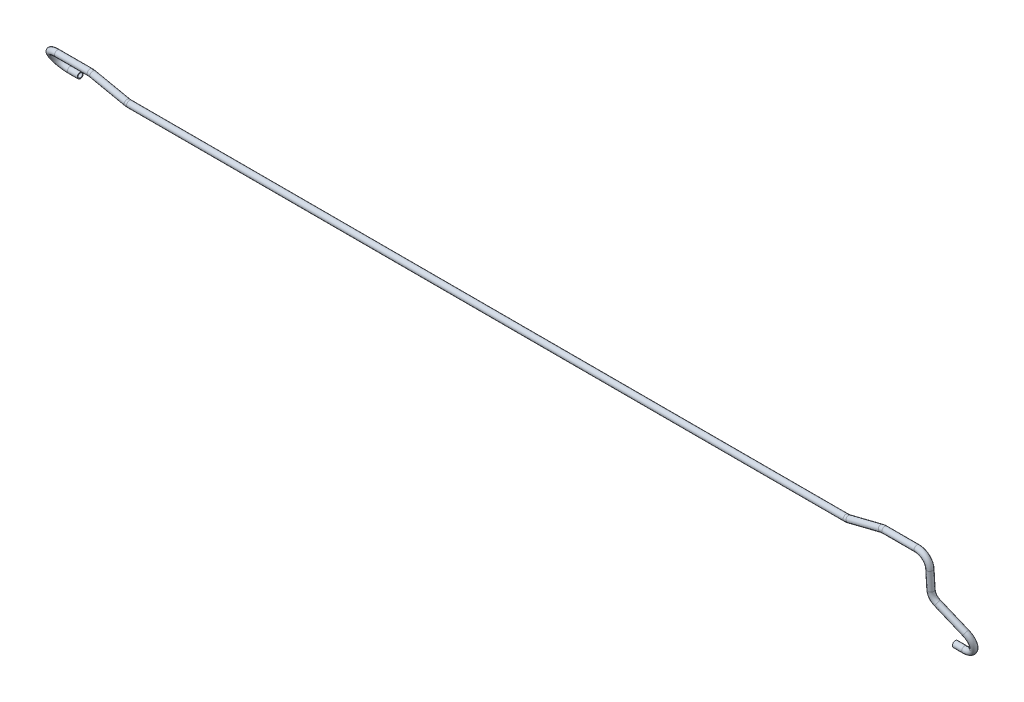
ISO-10303-21;
HEADER;
FILE_DESCRIPTION(('STEP AP214'),'2;1');
FILE_NAME('part.step','',(''),(''),'','','');
FILE_SCHEMA(('AUTOMOTIVE_DESIGN { 1 0 10303 214 1 1 1 1 }'));
ENDSEC;
DATA;
#1=APPLICATION_CONTEXT('core data for automotive mechanical design processes');
#2=APPLICATION_PROTOCOL_DEFINITION('international standard','automotive_design',2000,#1);
#3=PRODUCT_CONTEXT('',#1,'mechanical');
#4=PRODUCT('Part','Part','',(#3));
#5=PRODUCT_RELATED_PRODUCT_CATEGORY('part','',(#4));
#6=PRODUCT_DEFINITION_FORMATION('','',#4);
#7=PRODUCT_DEFINITION_CONTEXT('part definition',#1,'design');
#8=PRODUCT_DEFINITION('design','',#6,#7);
#9=PRODUCT_DEFINITION_SHAPE('','',#8);
#10=(LENGTH_UNIT() NAMED_UNIT(*) SI_UNIT(.MILLI.,.METRE.));
#11=(NAMED_UNIT(*) PLANE_ANGLE_UNIT() SI_UNIT($,.RADIAN.));
#12=(NAMED_UNIT(*) SI_UNIT($,.STERADIAN.) SOLID_ANGLE_UNIT());
#13=UNCERTAINTY_MEASURE_WITH_UNIT(LENGTH_MEASURE(1.E-05),#10,'distance_accuracy_value','');
#14=(GEOMETRIC_REPRESENTATION_CONTEXT(3) GLOBAL_UNCERTAINTY_ASSIGNED_CONTEXT((#13)) GLOBAL_UNIT_ASSIGNED_CONTEXT((#10,
#11,#12)) REPRESENTATION_CONTEXT('',''));
#15=CARTESIAN_POINT('',(0.,0.,0.));
#16=DIRECTION('',(0.,0.,1.));
#17=DIRECTION('',(1.,0.,0.));
#18=AXIS2_PLACEMENT_3D('',#15,#16,#17);
#19=CARTESIAN_POINT('',(-2402.5,149.044660665849,-2.77555756156289E-13));
#20=DIRECTION('',(1.,0.,0.));
#21=DIRECTION('',(0.,1.,0.));
#22=AXIS2_PLACEMENT_3D('',#19,#20,#21);
#23=CYLINDRICAL_SURFACE('',#22,8.);
#24=CARTESIAN_POINT('',(-2402.5,149.044660665849,-2.77555756156289E-13));
#25=DIRECTION('',(1.,0.,0.));
#26=DIRECTION('',(0.,0.610910901887657,-0.791699355787796));
#27=AXIS2_PLACEMENT_3D('',#24,#25,#26);
#28=CIRCLE('',#27,8.);
#29=CARTESIAN_POINT('',(-2402.5,142.262195292013,-4.24242424242452));
#30=VERTEX_POINT('',#29);
#31=EDGE_CURVE('E47',#30,#30,#28,.T.);
#32=ORIENTED_EDGE('',*,*,#31,.T.);
#33=EDGE_LOOP('',(#32));
#34=FACE_BOUND('',#33,.T.);
#35=CARTESIAN_POINT('',(-2375.5,149.044660665849,-2.22044604925031E-13));
#36=DIRECTION('',(1.,0.,0.));
#37=DIRECTION('',(0.,0.610910901887657,-0.791699355787796));
#38=AXIS2_PLACEMENT_3D('',#35,#36,#37);
#39=CIRCLE('',#38,8.);
#40=CARTESIAN_POINT('',(-2375.5,153.93194788095,-6.33359484630259));
#41=VERTEX_POINT('',#40);
#42=EDGE_CURVE('E10',#41,#41,#39,.T.);
#43=ORIENTED_EDGE('',*,*,#42,.F.);
#44=EDGE_LOOP('',(#43));
#45=FACE_BOUND('',#44,.T.);
#46=ADVANCED_FACE('F37',(#34,#45),#23,.T.);
#47=CARTESIAN_POINT('',(-2402.5,149.044660665849,-2.77555756156289E-13));
#48=DIRECTION('',(1.,0.,0.));
#49=DIRECTION('',(0.,1.,0.));
#50=AXIS2_PLACEMENT_3D('',#47,#48,#49);
#51=CYLINDRICAL_SURFACE('',#50,6.);
#52=CARTESIAN_POINT('',(-2402.5,149.044660665849,-2.77555756156289E-13));
#53=DIRECTION('',(1.,0.,0.));
#54=DIRECTION('',(0.,0.610910901887657,-0.791699355787796));
#55=AXIS2_PLACEMENT_3D('',#52,#53,#54);
#56=CIRCLE('',#55,6.);
#57=CARTESIAN_POINT('',(-2402.5,143.957811635472,-3.18181818181845));
#58=VERTEX_POINT('',#57);
#59=EDGE_CURVE('E51',#58,#58,#56,.T.);
#60=ORIENTED_EDGE('',*,*,#59,.F.);
#61=EDGE_LOOP('',(#60));
#62=FACE_BOUND('',#61,.T.);
#63=CARTESIAN_POINT('',(-2375.5,149.044660665849,-2.22044604925031E-13));
#64=DIRECTION('',(1.,0.,0.));
#65=DIRECTION('',(0.,0.610910901887657,-0.791699355787796));
#66=AXIS2_PLACEMENT_3D('',#63,#64,#65);
#67=CIRCLE('',#66,6.);
#68=CARTESIAN_POINT('',(-2375.5,152.710126077175,-4.750196134727));
#69=VERTEX_POINT('',#68);
#70=EDGE_CURVE('E43',#69,#69,#67,.T.);
#71=ORIENTED_EDGE('',*,*,#70,.T.);
#72=EDGE_LOOP('',(#71));
#73=FACE_BOUND('',#72,.T.);
#74=ADVANCED_FACE('F261',(#62,#73),#51,.F.);
#75=CARTESIAN_POINT('',(-2402.5,177.022330332924,17.4999999999997));
#76=DIRECTION('',(0.,-0.530303030303033,0.847808171729561));
#77=DIRECTION('',(0.,-0.847808171729561,-0.530303030303033));
#78=AXIS2_PLACEMENT_3D('',#75,#76,#77);
#79=TOROIDAL_SURFACE('',#78,32.9999999999998,8.);
#80=CARTESIAN_POINT('',(-2402.5,205.,34.9999999999997));
#81=DIRECTION('',(-1.,0.,0.));
#82=DIRECTION('',(0.,0.444579946800643,-0.895739175710619));
#83=AXIS2_PLACEMENT_3D('',#80,#81,#82);
#84=CIRCLE('',#83,8.);
#85=CARTESIAN_POINT('',(-2402.5,211.782465373836,39.242424242424));
#86=VERTEX_POINT('',#85);
#87=EDGE_CURVE('E56',#86,#86,#84,.T.);
#88=CARTESIAN_POINT('',(-2402.5,177.022330332924,17.4999999999997));
#89=DIRECTION('',(0.,-0.530303030303033,0.847808171729561));
#90=DIRECTION('',(0.,-0.847808171729561,-0.530303030303033));
#91=AXIS2_PLACEMENT_3D('',#88,#89,#90);
#92=CIRCLE('',#91,40.9999999999998);
#93=EDGE_CURVE('',#86,#30,#92,.T.);
#94=ORIENTED_EDGE('',*,*,#87,.T.);
#95=ORIENTED_EDGE('',*,*,#31,.F.);
#96=ORIENTED_EDGE('',*,*,#93,.T.);
#97=ORIENTED_EDGE('',*,*,#93,.F.);
#98=EDGE_LOOP('',(#94,#96,#95,#97));
#99=FACE_BOUND('',#98,.T.);
#100=ADVANCED_FACE('F257',(#99),#79,.T.);
#101=CARTESIAN_POINT('',(-2402.5,177.022330332924,17.4999999999997));
#102=DIRECTION('',(0.,-0.530303030303033,0.847808171729561));
#103=DIRECTION('',(0.,-0.847808171729561,-0.530303030303033));
#104=AXIS2_PLACEMENT_3D('',#101,#102,#103);
#105=TOROIDAL_SURFACE('',#104,32.9999999999998,6.);
#106=CARTESIAN_POINT('',(-2402.5,205.,34.9999999999997));
#107=DIRECTION('',(-1.,0.,0.));
#108=DIRECTION('',(0.,0.444579946800643,-0.895739175710619));
#109=AXIS2_PLACEMENT_3D('',#106,#107,#108);
#110=CIRCLE('',#109,6.);
#111=CARTESIAN_POINT('',(-2402.5,210.086849030377,38.1818181818179));
#112=VERTEX_POINT('',#111);
#113=EDGE_CURVE('E59',#112,#112,#110,.T.);
#114=CARTESIAN_POINT('',(-2402.5,177.022330332924,17.4999999999997));
#115=DIRECTION('',(0.,-0.530303030303033,0.847808171729561));
#116=DIRECTION('',(0.,-0.847808171729561,-0.530303030303033));
#117=AXIS2_PLACEMENT_3D('',#114,#115,#116);
#118=CIRCLE('',#117,38.9999999999998);
#119=EDGE_CURVE('',#112,#58,#118,.T.);
#120=ORIENTED_EDGE('',*,*,#113,.F.);
#121=ORIENTED_EDGE('',*,*,#59,.T.);
#122=ORIENTED_EDGE('',*,*,#119,.T.);
#123=ORIENTED_EDGE('',*,*,#119,.F.);
#124=EDGE_LOOP('',(#120,#122,#121,#123));
#125=FACE_BOUND('',#124,.T.);
#126=ADVANCED_FACE('F254',(#125),#105,.F.);
#127=CARTESIAN_POINT('',(-2313.92761819748,205.,34.9999999999998));
#128=DIRECTION('',(-1.,0.,0.));
#129=DIRECTION('',(0.,0.,1.));
#130=AXIS2_PLACEMENT_3D('',#127,#128,#129);
#131=CYLINDRICAL_SURFACE('',#130,8.);
#132=CARTESIAN_POINT('',(-2313.92761819748,205.,34.9999999999998));
#133=DIRECTION('',(-1.,0.,0.));
#134=DIRECTION('',(0.,0.444579946800643,-0.895739175710619));
#135=AXIS2_PLACEMENT_3D('',#132,#133,#134);
#136=CIRCLE('',#135,8.);
#137=CARTESIAN_POINT('',(-2313.92761819748,213.,34.9999999999998));
#138=VERTEX_POINT('',#137);
#139=EDGE_CURVE('E62',#138,#138,#136,.T.);
#140=ORIENTED_EDGE('',*,*,#139,.T.);
#141=EDGE_LOOP('',(#140));
#142=FACE_BOUND('',#141,.T.);
#143=ORIENTED_EDGE('',*,*,#87,.F.);
#144=EDGE_LOOP('',(#143));
#145=FACE_BOUND('',#144,.T.);
#146=ADVANCED_FACE('F250',(#142,#145),#131,.T.);
#147=CARTESIAN_POINT('',(-2313.92761819748,205.,34.9999999999998));
#148=DIRECTION('',(-1.,0.,0.));
#149=DIRECTION('',(0.,0.,1.));
#150=AXIS2_PLACEMENT_3D('',#147,#148,#149);
#151=CYLINDRICAL_SURFACE('',#150,6.);
#152=CARTESIAN_POINT('',(-2313.92761819748,205.,34.9999999999998));
#153=DIRECTION('',(-1.,0.,0.));
#154=DIRECTION('',(0.,0.444579946800643,-0.895739175710619));
#155=AXIS2_PLACEMENT_3D('',#152,#153,#154);
#156=CIRCLE('',#155,6.);
#157=CARTESIAN_POINT('',(-2313.92761819748,211.,34.9999999999998));
#158=VERTEX_POINT('',#157);
#159=EDGE_CURVE('E65',#158,#158,#156,.T.);
#160=ORIENTED_EDGE('',*,*,#159,.F.);
#161=EDGE_LOOP('',(#160));
#162=FACE_BOUND('',#161,.T.);
#163=ORIENTED_EDGE('',*,*,#113,.T.);
#164=EDGE_LOOP('',(#163));
#165=FACE_BOUND('',#164,.T.);
#166=ADVANCED_FACE('F247',(#162,#165),#151,.F.);
#167=CARTESIAN_POINT('',(-2313.92761819748,172.,34.9999999999998));
#168=DIRECTION('',(0.,0.,1.));
#169=DIRECTION('',(0.,-1.,0.));
#170=AXIS2_PLACEMENT_3D('',#167,#168,#169);
#171=TOROIDAL_SURFACE('',#170,33.,8.);
#172=CARTESIAN_POINT('',(-2307.14554946602,204.295565387865,34.9999999999998));
#173=DIRECTION('',(-0.978653496601971,0.205517234286411,0.));
#174=DIRECTION('',(0.0913688410856702,0.435089719455567,-0.895739175710619));
#175=AXIS2_PLACEMENT_3D('',#172,#173,#174);
#176=CIRCLE('',#175,8.);
#177=CARTESIAN_POINT('',(-2305.50141159173,212.124793360681,34.9999999999998));
#178=VERTEX_POINT('',#177);
#179=EDGE_CURVE('E68',#178,#178,#176,.T.);
#180=CARTESIAN_POINT('',(-2313.92761819748,172.,34.9999999999998));
#181=DIRECTION('',(0.,0.,1.));
#182=DIRECTION('',(0.,-1.,0.));
#183=AXIS2_PLACEMENT_3D('',#180,#181,#182);
#184=CIRCLE('',#183,41.);
#185=EDGE_CURVE('',#178,#138,#184,.T.);
#186=ORIENTED_EDGE('',*,*,#179,.T.);
#187=ORIENTED_EDGE('',*,*,#139,.F.);
#188=ORIENTED_EDGE('',*,*,#185,.T.);
#189=ORIENTED_EDGE('',*,*,#185,.F.);
#190=EDGE_LOOP('',(#186,#188,#187,#189));
#191=FACE_BOUND('',#190,.T.);
#192=ADVANCED_FACE('F243',(#191),#171,.T.);
#193=CARTESIAN_POINT('',(-2313.92761819748,172.,34.9999999999998));
#194=DIRECTION('',(0.,0.,1.));
#195=DIRECTION('',(0.,-1.,0.));
#196=AXIS2_PLACEMENT_3D('',#193,#194,#195);
#197=TOROIDAL_SURFACE('',#196,33.,6.);
#198=CARTESIAN_POINT('',(-2307.14554946602,204.295565387865,34.9999999999998));
#199=DIRECTION('',(-0.978653496601971,0.205517234286411,0.));
#200=DIRECTION('',(0.0913688410856702,0.435089719455567,-0.895739175710619));
#201=AXIS2_PLACEMENT_3D('',#198,#199,#200);
#202=CIRCLE('',#201,6.);
#203=CARTESIAN_POINT('',(-2305.91244606031,210.167486367477,34.9999999999998));
#204=VERTEX_POINT('',#203);
#205=EDGE_CURVE('E71',#204,#204,#202,.T.);
#206=CARTESIAN_POINT('',(-2313.92761819748,172.,34.9999999999998));
#207=DIRECTION('',(0.,0.,1.));
#208=DIRECTION('',(0.,-1.,0.));
#209=AXIS2_PLACEMENT_3D('',#206,#207,#208);
#210=CIRCLE('',#209,39.);
#211=EDGE_CURVE('',#204,#158,#210,.T.);
#212=ORIENTED_EDGE('',*,*,#205,.F.);
#213=ORIENTED_EDGE('',*,*,#159,.T.);
#214=ORIENTED_EDGE('',*,*,#211,.T.);
#215=ORIENTED_EDGE('',*,*,#211,.F.);
#216=EDGE_LOOP('',(#212,#214,#213,#215));
#217=FACE_BOUND('',#216,.T.);
#218=ADVANCED_FACE('F240',(#217),#197,.F.);
#219=CARTESIAN_POINT('',(-2213.85445053398,184.704434612135,34.9999999999999));
#220=DIRECTION('',(-0.978653496601971,0.205517234286413,0.));
#221=DIRECTION('',(-0.205517234286413,-0.978653496601971,0.));
#222=AXIS2_PLACEMENT_3D('',#219,#220,#221);
#223=CYLINDRICAL_SURFACE('',#222,8.);
#224=CARTESIAN_POINT('',(-2213.85445053398,184.704434612135,34.9999999999999));
#225=DIRECTION('',(-0.978653496601971,0.205517234286411,0.));
#226=DIRECTION('',(0.0913688410856702,0.435089719455567,-0.895739175710619));
#227=AXIS2_PLACEMENT_3D('',#224,#225,#226);
#228=CIRCLE('',#227,8.);
#229=CARTESIAN_POINT('',(-2215.49858840827,176.875206639319,34.9999999999999));
#230=VERTEX_POINT('',#229);
#231=EDGE_CURVE('E74',#230,#230,#228,.T.);
#232=ORIENTED_EDGE('',*,*,#231,.T.);
#233=EDGE_LOOP('',(#232));
#234=FACE_BOUND('',#233,.T.);
#235=ORIENTED_EDGE('',*,*,#179,.F.);
#236=EDGE_LOOP('',(#235));
#237=FACE_BOUND('',#236,.T.);
#238=ADVANCED_FACE('F236',(#234,#237),#223,.T.);
#239=CARTESIAN_POINT('',(-2213.85445053398,184.704434612135,34.9999999999999));
#240=DIRECTION('',(-0.978653496601971,0.205517234286413,0.));
#241=DIRECTION('',(-0.205517234286413,-0.978653496601971,0.));
#242=AXIS2_PLACEMENT_3D('',#239,#240,#241);
#243=CYLINDRICAL_SURFACE('',#242,6.);
#244=CARTESIAN_POINT('',(-2213.85445053398,184.704434612135,34.9999999999999));
#245=DIRECTION('',(-0.978653496601971,0.205517234286411,0.));
#246=DIRECTION('',(0.0913688410856702,0.435089719455567,-0.895739175710619));
#247=AXIS2_PLACEMENT_3D('',#244,#245,#246);
#248=CIRCLE('',#247,6.);
#249=CARTESIAN_POINT('',(-2215.08755393969,178.832513632523,34.9999999999999));
#250=VERTEX_POINT('',#249);
#251=EDGE_CURVE('E77',#250,#250,#248,.T.);
#252=ORIENTED_EDGE('',*,*,#251,.F.);
#253=EDGE_LOOP('',(#252));
#254=FACE_BOUND('',#253,.T.);
#255=ORIENTED_EDGE('',*,*,#205,.T.);
#256=EDGE_LOOP('',(#255));
#257=FACE_BOUND('',#256,.T.);
#258=ADVANCED_FACE('F233',(#254,#257),#243,.F.);
#259=CARTESIAN_POINT('',(-2207.07238180252,217.,34.9999999999999));
#260=DIRECTION('',(0.,0.,-1.));
#261=DIRECTION('',(0.,1.,0.));
#262=AXIS2_PLACEMENT_3D('',#259,#260,#261);
#263=TOROIDAL_SURFACE('',#262,32.9999999999999,8.);
#264=CARTESIAN_POINT('',(-2207.07238180252,184.,34.9999999999999));
#265=DIRECTION('',(-1.,0.,0.));
#266=DIRECTION('',(0.,0.444579946800643,-0.895739175710619));
#267=AXIS2_PLACEMENT_3D('',#264,#265,#266);
#268=CIRCLE('',#267,8.);
#269=CARTESIAN_POINT('',(-2207.07238180252,176.,34.9999999999999));
#270=VERTEX_POINT('',#269);
#271=EDGE_CURVE('E80',#270,#270,#268,.T.);
#272=CARTESIAN_POINT('',(-2207.07238180252,217.,34.9999999999999));
#273=DIRECTION('',(0.,0.,-1.));
#274=DIRECTION('',(0.,1.,0.));
#275=AXIS2_PLACEMENT_3D('',#272,#273,#274);
#276=CIRCLE('',#275,40.9999999999999);
#277=EDGE_CURVE('',#270,#230,#276,.T.);
#278=ORIENTED_EDGE('',*,*,#271,.T.);
#279=ORIENTED_EDGE('',*,*,#231,.F.);
#280=ORIENTED_EDGE('',*,*,#277,.T.);
#281=ORIENTED_EDGE('',*,*,#277,.F.);
#282=EDGE_LOOP('',(#278,#280,#279,#281));
#283=FACE_BOUND('',#282,.T.);
#284=ADVANCED_FACE('F229',(#283),#263,.T.);
#285=CARTESIAN_POINT('',(-2207.07238180252,217.,34.9999999999999));
#286=DIRECTION('',(0.,0.,-1.));
#287=DIRECTION('',(0.,1.,0.));
#288=AXIS2_PLACEMENT_3D('',#285,#286,#287);
#289=TOROIDAL_SURFACE('',#288,32.9999999999999,6.);
#290=CARTESIAN_POINT('',(-2207.07238180252,184.,34.9999999999999));
#291=DIRECTION('',(-1.,0.,0.));
#292=DIRECTION('',(0.,0.444579946800643,-0.895739175710619));
#293=AXIS2_PLACEMENT_3D('',#290,#291,#292);
#294=CIRCLE('',#293,6.);
#295=CARTESIAN_POINT('',(-2207.07238180252,178.,34.9999999999999));
#296=VERTEX_POINT('',#295);
#297=EDGE_CURVE('E83',#296,#296,#294,.T.);
#298=CARTESIAN_POINT('',(-2207.07238180252,217.,34.9999999999999));
#299=DIRECTION('',(0.,0.,-1.));
#300=DIRECTION('',(0.,1.,0.));
#301=AXIS2_PLACEMENT_3D('',#298,#299,#300);
#302=CIRCLE('',#301,38.9999999999999);
#303=EDGE_CURVE('',#296,#250,#302,.T.);
#304=ORIENTED_EDGE('',*,*,#297,.F.);
#305=ORIENTED_EDGE('',*,*,#251,.T.);
#306=ORIENTED_EDGE('',*,*,#303,.T.);
#307=ORIENTED_EDGE('',*,*,#303,.F.);
#308=EDGE_LOOP('',(#304,#306,#305,#307));
#309=FACE_BOUND('',#308,.T.);
#310=ADVANCED_FACE('F226',(#309),#289,.F.);
#311=CARTESIAN_POINT('',(-261.577123371987,184.,34.9999999999999));
#312=DIRECTION('',(-1.,0.,0.));
#313=DIRECTION('',(0.,-1.,0.));
#314=AXIS2_PLACEMENT_3D('',#311,#312,#313);
#315=CYLINDRICAL_SURFACE('',#314,8.);
#316=CARTESIAN_POINT('',(-261.577123371987,184.,34.9999999999999));
#317=DIRECTION('',(-1.,0.,0.));
#318=DIRECTION('',(0.,0.444579946800643,-0.895739175710619));
#319=AXIS2_PLACEMENT_3D('',#316,#317,#318);
#320=CIRCLE('',#319,8.);
#321=CARTESIAN_POINT('',(-261.577123371987,176.08040405071,33.8686291501014));
#322=VERTEX_POINT('',#321);
#323=EDGE_CURVE('E86',#322,#322,#320,.T.);
#324=ORIENTED_EDGE('',*,*,#323,.T.);
#325=EDGE_LOOP('',(#324));
#326=FACE_BOUND('',#325,.T.);
#327=ORIENTED_EDGE('',*,*,#271,.F.);
#328=EDGE_LOOP('',(#327));
#329=FACE_BOUND('',#328,.T.);
#330=ADVANCED_FACE('F222',(#326,#329),#315,.T.);
#331=CARTESIAN_POINT('',(-261.577123371987,184.,34.9999999999999));
#332=DIRECTION('',(-1.,0.,0.));
#333=DIRECTION('',(0.,-1.,0.));
#334=AXIS2_PLACEMENT_3D('',#331,#332,#333);
#335=CYLINDRICAL_SURFACE('',#334,6.);
#336=CARTESIAN_POINT('',(-261.577123371987,184.,34.9999999999999));
#337=DIRECTION('',(-1.,0.,0.));
#338=DIRECTION('',(0.,0.444579946800643,-0.895739175710619));
#339=AXIS2_PLACEMENT_3D('',#336,#337,#338);
#340=CIRCLE('',#339,6.);
#341=CARTESIAN_POINT('',(-261.577123371987,178.060303038033,34.151471862576));
#342=VERTEX_POINT('',#341);
#343=EDGE_CURVE('E89',#342,#342,#340,.T.);
#344=ORIENTED_EDGE('',*,*,#343,.F.);
#345=EDGE_LOOP('',(#344));
#346=FACE_BOUND('',#345,.T.);
#347=ORIENTED_EDGE('',*,*,#297,.T.);
#348=EDGE_LOOP('',(#347));
#349=FACE_BOUND('',#348,.T.);
#350=ADVANCED_FACE('F219',(#346,#349),#335,.F.);
#351=CARTESIAN_POINT('',(-261.577123371987,216.668333290818,39.6669047558311));
#352=DIRECTION('',(0.,0.141421356237309,-0.989949493661167));
#353=DIRECTION('',(0.,0.989949493661167,0.141421356237309));
#354=AXIS2_PLACEMENT_3D('',#351,#352,#353);
#355=TOROIDAL_SURFACE('',#354,32.9999999999999,8.);
#356=CARTESIAN_POINT('',(-252.595660981782,185.233214925101,35.1761735607286));
#357=DIRECTION('',(-0.962250448649378,-0.269430125621821,-0.0384900179459771));
#358=DIRECTION('',(-0.0853062139674232,0.432866832421495,-0.897412477764783));
#359=AXIS2_PLACEMENT_3D('',#356,#357,#358);
#360=CIRCLE('',#359,8.);
#361=CARTESIAN_POINT('',(-250.418336765975,177.612580169775,34.087511452825));
#362=VERTEX_POINT('',#361);
#363=EDGE_CURVE('E92',#362,#362,#360,.T.);
#364=CARTESIAN_POINT('',(-261.577123371987,216.668333290818,39.6669047558311));
#365=DIRECTION('',(0.,0.141421356237309,-0.989949493661167));
#366=DIRECTION('',(0.,0.989949493661167,0.141421356237309));
#367=AXIS2_PLACEMENT_3D('',#364,#365,#366);
#368=CIRCLE('',#367,40.9999999999999);
#369=EDGE_CURVE('',#362,#322,#368,.T.);
#370=ORIENTED_EDGE('',*,*,#363,.T.);
#371=ORIENTED_EDGE('',*,*,#323,.F.);
#372=ORIENTED_EDGE('',*,*,#369,.T.);
#373=ORIENTED_EDGE('',*,*,#369,.F.);
#374=EDGE_LOOP('',(#370,#372,#371,#373));
#375=FACE_BOUND('',#374,.T.);
#376=ADVANCED_FACE('F215',(#375),#355,.T.);
#377=CARTESIAN_POINT('',(-261.577123371987,216.668333290818,39.6669047558311));
#378=DIRECTION('',(0.,0.141421356237309,-0.989949493661167));
#379=DIRECTION('',(0.,0.989949493661167,0.141421356237309));
#380=AXIS2_PLACEMENT_3D('',#377,#378,#379);
#381=TOROIDAL_SURFACE('',#380,32.9999999999999,6.);
#382=CARTESIAN_POINT('',(-252.595660981782,185.233214925101,35.1761735607286));
#383=DIRECTION('',(-0.962250448649378,-0.269430125621821,-0.0384900179459771));
#384=DIRECTION('',(-0.0853062139674232,0.432866832421495,-0.897412477764783));
#385=AXIS2_PLACEMENT_3D('',#382,#383,#384);
#386=CIRCLE('',#385,6.);
#387=CARTESIAN_POINT('',(-250.962667819927,179.517738858607,34.3596769798009));
#388=VERTEX_POINT('',#387);
#389=EDGE_CURVE('E95',#388,#388,#386,.T.);
#390=CARTESIAN_POINT('',(-261.577123371987,216.668333290818,39.6669047558311));
#391=DIRECTION('',(0.,0.141421356237309,-0.989949493661167));
#392=DIRECTION('',(0.,0.989949493661167,0.141421356237309));
#393=AXIS2_PLACEMENT_3D('',#390,#391,#392);
#394=CIRCLE('',#393,38.9999999999999);
#395=EDGE_CURVE('',#388,#342,#394,.T.);
#396=ORIENTED_EDGE('',*,*,#389,.F.);
#397=ORIENTED_EDGE('',*,*,#343,.T.);
#398=ORIENTED_EDGE('',*,*,#395,.T.);
#399=ORIENTED_EDGE('',*,*,#395,.F.);
#400=EDGE_LOOP('',(#396,#398,#397,#399));
#401=FACE_BOUND('',#400,.T.);
#402=ADVANCED_FACE('F212',(#401),#381,.F.);
#403=CARTESIAN_POINT('',(-161.404339018217,210.766785074899,38.8238264392713));
#404=DIRECTION('',(-0.962250448649376,-0.269430125621826,-0.0384900179459756));
#405=DIRECTION('',(0.269629925519972,-0.962964019714182,0.));
#406=AXIS2_PLACEMENT_3D('',#403,#404,#405);
#407=CYLINDRICAL_SURFACE('',#406,8.);
#408=CARTESIAN_POINT('',(-161.404339018217,210.766785074899,38.8238264392713));
#409=DIRECTION('',(-0.962250448649378,-0.269430125621821,-0.0384900179459771));
#410=DIRECTION('',(-0.0853062139674232,0.432866832421495,-0.897412477764783));
#411=AXIS2_PLACEMENT_3D('',#408,#409,#410);
#412=CIRCLE('',#411,8.);
#413=CARTESIAN_POINT('',(-163.581663234024,218.387419830224,39.9124885471749));
#414=VERTEX_POINT('',#413);
#415=EDGE_CURVE('E98',#414,#414,#412,.T.);
#416=ORIENTED_EDGE('',*,*,#415,.T.);
#417=EDGE_LOOP('',(#416));
#418=FACE_BOUND('',#417,.T.);
#419=ORIENTED_EDGE('',*,*,#363,.F.);
#420=EDGE_LOOP('',(#419));
#421=FACE_BOUND('',#420,.T.);
#422=ADVANCED_FACE('F208',(#418,#421),#407,.T.);
#423=CARTESIAN_POINT('',(-161.404339018217,210.766785074899,38.8238264392713));
#424=DIRECTION('',(-0.962250448649376,-0.269430125621826,-0.0384900179459756));
#425=DIRECTION('',(0.269629925519972,-0.962964019714182,0.));
#426=AXIS2_PLACEMENT_3D('',#423,#424,#425);
#427=CYLINDRICAL_SURFACE('',#426,6.);
#428=CARTESIAN_POINT('',(-161.404339018217,210.766785074899,38.8238264392713));
#429=DIRECTION('',(-0.962250448649378,-0.269430125621821,-0.0384900179459771));
#430=DIRECTION('',(-0.0853062139674232,0.432866832421495,-0.897412477764783));
#431=AXIS2_PLACEMENT_3D('',#428,#429,#430);
#432=CIRCLE('',#431,6.);
#433=CARTESIAN_POINT('',(-163.037332180073,216.482261141393,39.640323020199));
#434=VERTEX_POINT('',#433);
#435=EDGE_CURVE('E101',#434,#434,#432,.T.);
#436=ORIENTED_EDGE('',*,*,#435,.F.);
#437=EDGE_LOOP('',(#436));
#438=FACE_BOUND('',#437,.T.);
#439=ORIENTED_EDGE('',*,*,#389,.T.);
#440=EDGE_LOOP('',(#439));
#441=FACE_BOUND('',#440,.T.);
#442=ADVANCED_FACE('F205',(#438,#441),#427,.F.);
#443=CARTESIAN_POINT('',(-152.422876628013,179.331666709181,34.3330952441687));
#444=DIRECTION('',(0.,-0.141421356237309,0.989949493661167));
#445=DIRECTION('',(0.,-0.989949493661167,-0.141421356237309));
#446=AXIS2_PLACEMENT_3D('',#443,#444,#445);
#447=TOROIDAL_SURFACE('',#446,33.0000000000002,8.);
#448=CARTESIAN_POINT('',(-152.422876628012,212.,38.9999999999999));
#449=DIRECTION('',(-1.,0.,0.));
#450=DIRECTION('',(0.,0.444579946800643,-0.895739175710619));
#451=AXIS2_PLACEMENT_3D('',#448,#449,#450);
#452=CIRCLE('',#451,8.);
#453=CARTESIAN_POINT('',(-152.422876628012,219.919595949289,40.1313708498984));
#454=VERTEX_POINT('',#453);
#455=EDGE_CURVE('E104',#454,#454,#452,.T.);
#456=CARTESIAN_POINT('',(-152.422876628013,179.331666709181,34.3330952441687));
#457=DIRECTION('',(0.,-0.141421356237309,0.989949493661167));
#458=DIRECTION('',(0.,-0.989949493661167,-0.141421356237309));
#459=AXIS2_PLACEMENT_3D('',#456,#457,#458);
#460=CIRCLE('',#459,41.0000000000002);
#461=EDGE_CURVE('',#454,#414,#460,.T.);
#462=ORIENTED_EDGE('',*,*,#455,.T.);
#463=ORIENTED_EDGE('',*,*,#415,.F.);
#464=ORIENTED_EDGE('',*,*,#461,.T.);
#465=ORIENTED_EDGE('',*,*,#461,.F.);
#466=EDGE_LOOP('',(#462,#464,#463,#465));
#467=FACE_BOUND('',#466,.T.);
#468=ADVANCED_FACE('F201',(#467),#447,.T.);
#469=CARTESIAN_POINT('',(-152.422876628013,179.331666709181,34.3330952441687));
#470=DIRECTION('',(0.,-0.141421356237309,0.989949493661167));
#471=DIRECTION('',(0.,-0.989949493661167,-0.141421356237309));
#472=AXIS2_PLACEMENT_3D('',#469,#470,#471);
#473=TOROIDAL_SURFACE('',#472,33.0000000000002,6.);
#474=CARTESIAN_POINT('',(-152.422876628012,212.,38.9999999999999));
#475=DIRECTION('',(-1.,0.,0.));
#476=DIRECTION('',(0.,0.444579946800643,-0.895739175710619));
#477=AXIS2_PLACEMENT_3D('',#474,#475,#476);
#478=CIRCLE('',#477,6.);
#479=CARTESIAN_POINT('',(-152.422876628012,217.939696961967,39.8485281374238));
#480=VERTEX_POINT('',#479);
#481=EDGE_CURVE('E107',#480,#480,#478,.T.);
#482=CARTESIAN_POINT('',(-152.422876628013,179.331666709181,34.3330952441687));
#483=DIRECTION('',(0.,-0.141421356237309,0.989949493661167));
#484=DIRECTION('',(0.,-0.989949493661167,-0.141421356237309));
#485=AXIS2_PLACEMENT_3D('',#482,#483,#484);
#486=CIRCLE('',#485,39.0000000000002);
#487=EDGE_CURVE('',#480,#434,#486,.T.);
#488=ORIENTED_EDGE('',*,*,#481,.F.);
#489=ORIENTED_EDGE('',*,*,#435,.T.);
#490=ORIENTED_EDGE('',*,*,#487,.T.);
#491=ORIENTED_EDGE('',*,*,#487,.F.);
#492=EDGE_LOOP('',(#488,#490,#489,#491));
#493=FACE_BOUND('',#492,.T.);
#494=ADVANCED_FACE('F198',(#493),#473,.F.);
#495=CARTESIAN_POINT('',(-65.,212.,39.));
#496=DIRECTION('',(-1.,0.,0.));
#497=DIRECTION('',(0.,0.,1.));
#498=AXIS2_PLACEMENT_3D('',#495,#496,#497);
#499=CYLINDRICAL_SURFACE('',#498,8.);
#500=CARTESIAN_POINT('',(-65.,212.,39.));
#501=DIRECTION('',(-1.,0.,0.));
#502=DIRECTION('',(0.,0.444579946800643,-0.895739175710619));
#503=AXIS2_PLACEMENT_3D('',#500,#501,#502);
#504=CIRCLE('',#503,8.);
#505=CARTESIAN_POINT('',(-65.,219.985638763726,39.4791383258236));
#506=VERTEX_POINT('',#505);
#507=EDGE_CURVE('E110',#506,#506,#504,.T.);
#508=ORIENTED_EDGE('',*,*,#507,.T.);
#509=EDGE_LOOP('',(#508));
#510=FACE_BOUND('',#509,.T.);
#511=ORIENTED_EDGE('',*,*,#455,.F.);
#512=EDGE_LOOP('',(#511));
#513=FACE_BOUND('',#512,.T.);
#514=ADVANCED_FACE('F194',(#510,#513),#499,.T.);
#515=CARTESIAN_POINT('',(-65.,212.,39.));
#516=DIRECTION('',(-1.,0.,0.));
#517=DIRECTION('',(0.,0.,1.));
#518=AXIS2_PLACEMENT_3D('',#515,#516,#517);
#519=CYLINDRICAL_SURFACE('',#518,6.);
#520=CARTESIAN_POINT('',(-65.,212.,39.));
#521=DIRECTION('',(-1.,0.,0.));
#522=DIRECTION('',(0.,0.444579946800643,-0.895739175710619));
#523=AXIS2_PLACEMENT_3D('',#520,#521,#522);
#524=CIRCLE('',#523,6.);
#525=CARTESIAN_POINT('',(-65.,217.989229072794,39.3593537443677));
#526=VERTEX_POINT('',#525);
#527=EDGE_CURVE('E113',#526,#526,#524,.T.);
#528=ORIENTED_EDGE('',*,*,#527,.F.);
#529=EDGE_LOOP('',(#528));
#530=FACE_BOUND('',#529,.T.);
#531=ORIENTED_EDGE('',*,*,#481,.T.);
#532=EDGE_LOOP('',(#531));
#533=FACE_BOUND('',#532,.T.);
#534=ADVANCED_FACE('F191',(#530,#533),#519,.F.);
#535=CARTESIAN_POINT('',(-65.,179.059240099629,37.0235544059777));
#536=DIRECTION('',(0.,-0.0598922907279484,0.998204845465779));
#537=DIRECTION('',(0.,-0.998204845465779,-0.0598922907279484));
#538=AXIS2_PLACEMENT_3D('',#535,#536,#537);
#539=TOROIDAL_SURFACE('',#538,33.,8.);
#540=CARTESIAN_POINT('',(-32.,179.059240099629,37.0235544059777));
#541=DIRECTION('',(0.,0.998204845465779,0.0598922907279461));
#542=DIRECTION('',(0.390133985965247,0.0551463116292529,-0.919105193820903));
#543=AXIS2_PLACEMENT_3D('',#540,#541,#542);
#544=CIRCLE('',#543,8.);
#545=CARTESIAN_POINT('',(-24.,179.059240099629,37.0235544059777));
#546=VERTEX_POINT('',#545);
#547=EDGE_CURVE('E116',#546,#546,#544,.T.);
#548=CARTESIAN_POINT('',(-65.,179.059240099629,37.0235544059777));
#549=DIRECTION('',(0.,-0.0598922907279484,0.998204845465779));
#550=DIRECTION('',(0.,-0.998204845465779,-0.0598922907279484));
#551=AXIS2_PLACEMENT_3D('',#548,#549,#550);
#552=CIRCLE('',#551,41.);
#553=EDGE_CURVE('',#546,#506,#552,.T.);
#554=ORIENTED_EDGE('',*,*,#547,.T.);
#555=ORIENTED_EDGE('',*,*,#507,.F.);
#556=ORIENTED_EDGE('',*,*,#553,.T.);
#557=ORIENTED_EDGE('',*,*,#553,.F.);
#558=EDGE_LOOP('',(#554,#556,#555,#557));
#559=FACE_BOUND('',#558,.T.);
#560=ADVANCED_FACE('F187',(#559),#539,.T.);
#561=CARTESIAN_POINT('',(-65.,179.059240099629,37.0235544059777));
#562=DIRECTION('',(0.,-0.0598922907279484,0.998204845465779));
#563=DIRECTION('',(0.,-0.998204845465779,-0.0598922907279484));
#564=AXIS2_PLACEMENT_3D('',#561,#562,#563);
#565=TOROIDAL_SURFACE('',#564,33.,6.);
#566=CARTESIAN_POINT('',(-32.,179.059240099629,37.0235544059777));
#567=DIRECTION('',(0.,0.998204845465779,0.0598922907279461));
#568=DIRECTION('',(0.390133985965247,0.0551463116292529,-0.919105193820903));
#569=AXIS2_PLACEMENT_3D('',#566,#567,#568);
#570=CIRCLE('',#569,6.);
#571=CARTESIAN_POINT('',(-26.,179.059240099629,37.0235544059777));
#572=VERTEX_POINT('',#571);
#573=EDGE_CURVE('E119',#572,#572,#570,.T.);
#574=CARTESIAN_POINT('',(-65.,179.059240099629,37.0235544059777));
#575=DIRECTION('',(0.,-0.0598922907279484,0.998204845465779));
#576=DIRECTION('',(0.,-0.998204845465779,-0.0598922907279484));
#577=AXIS2_PLACEMENT_3D('',#574,#575,#576);
#578=CIRCLE('',#577,39.);
#579=EDGE_CURVE('',#572,#526,#578,.T.);
#580=ORIENTED_EDGE('',*,*,#573,.F.);
#581=ORIENTED_EDGE('',*,*,#527,.T.);
#582=ORIENTED_EDGE('',*,*,#579,.T.);
#583=ORIENTED_EDGE('',*,*,#579,.F.);
#584=EDGE_LOOP('',(#580,#582,#581,#583));
#585=FACE_BOUND('',#584,.T.);
#586=ADVANCED_FACE('F184',(#585),#565,.F.);
#587=CARTESIAN_POINT('',(-32.,128.945157365176,34.0167094419105));
#588=DIRECTION('',(0.,0.998204845465779,0.0598922907279467));
#589=DIRECTION('',(0.,-0.0598922907279467,0.998204845465779));
#590=AXIS2_PLACEMENT_3D('',#587,#588,#589);
#591=CYLINDRICAL_SURFACE('',#590,8.);
#592=CARTESIAN_POINT('',(-32.,128.945157365176,34.0167094419105));
#593=DIRECTION('',(0.,0.998204845465779,0.0598922907279461));
#594=DIRECTION('',(0.390133985965247,0.0551463116292529,-0.919105193820903));
#595=AXIS2_PLACEMENT_3D('',#592,#593,#594);
#596=CIRCLE('',#595,8.);
#597=CARTESIAN_POINT('',(-39.8906115470099,128.866193759715,35.3327695329422));
#598=VERTEX_POINT('',#597);
#599=EDGE_CURVE('E122',#598,#598,#596,.T.);
#600=ORIENTED_EDGE('',*,*,#599,.T.);
#601=EDGE_LOOP('',(#600));
#602=FACE_BOUND('',#601,.T.);
#603=ORIENTED_EDGE('',*,*,#547,.F.);
#604=EDGE_LOOP('',(#603));
#605=FACE_BOUND('',#604,.T.);
#606=ADVANCED_FACE('F180',(#602,#605),#591,.T.);
#607=CARTESIAN_POINT('',(-32.,128.945157365176,34.0167094419105));
#608=DIRECTION('',(0.,0.998204845465779,0.0598922907279467));
#609=DIRECTION('',(0.,-0.0598922907279467,0.998204845465779));
#610=AXIS2_PLACEMENT_3D('',#607,#608,#609);
#611=CYLINDRICAL_SURFACE('',#610,6.);
#612=CARTESIAN_POINT('',(-32.,128.945157365176,34.0167094419105));
#613=DIRECTION('',(0.,0.998204845465779,0.0598922907279461));
#614=DIRECTION('',(0.390133985965247,0.0551463116292529,-0.919105193820903));
#615=AXIS2_PLACEMENT_3D('',#612,#613,#614);
#616=CIRCLE('',#615,6.);
#617=CARTESIAN_POINT('',(-37.9179586602574,128.88593466108,35.0037545101843));
#618=VERTEX_POINT('',#617);
#619=EDGE_CURVE('E125',#618,#618,#616,.T.);
#620=ORIENTED_EDGE('',*,*,#619,.F.);
#621=EDGE_LOOP('',(#620));
#622=FACE_BOUND('',#621,.T.);
#623=ORIENTED_EDGE('',*,*,#573,.T.);
#624=EDGE_LOOP('',(#623));
#625=FACE_BOUND('',#624,.T.);
#626=ADVANCED_FACE('F177',(#622,#625),#611,.F.);
#627=CARTESIAN_POINT('',(0.548772631415891,129.270882237707,28.587961566405));
#628=DIRECTION('',(-0.164803358875898,0.0590733500993514,-0.98455583498919));
#629=DIRECTION('',(-0.986278227123706,0.,0.165091667572045));
#630=AXIS2_PLACEMENT_3D('',#627,#628,#629);
#631=TOROIDAL_SURFACE('',#630,33.,8.);
#632=CARTESIAN_POINT('',(-18.378395213197,102.282676839988,30.1368601403535));
#633=DIRECTION('',(-0.802421105226781,0.572427794811463,0.168661760971234));
#634=DIRECTION('',(0.168661760971234,0.48864874971893,-0.85602313624353));
#635=AXIS2_PLACEMENT_3D('',#632,#633,#634);
#636=CIRCLE('',#635,8.);
#637=CARTESIAN_POINT('',(-22.9667995391638,95.7400815920558,30.5123507037349));
#638=VERTEX_POINT('',#637);
#639=EDGE_CURVE('E128',#638,#638,#636,.T.);
#640=CARTESIAN_POINT('',(0.548772631415891,129.270882237707,28.587961566405));
#641=DIRECTION('',(-0.164803358875898,0.0590733500993514,-0.98455583498919));
#642=DIRECTION('',(-0.986278227123706,0.,0.165091667572045));
#643=AXIS2_PLACEMENT_3D('',#640,#641,#642);
#644=CIRCLE('',#643,41.);
#645=EDGE_CURVE('',#638,#598,#644,.T.);
#646=ORIENTED_EDGE('',*,*,#639,.T.);
#647=ORIENTED_EDGE('',*,*,#599,.F.);
#648=ORIENTED_EDGE('',*,*,#645,.T.);
#649=ORIENTED_EDGE('',*,*,#645,.F.);
#650=EDGE_LOOP('',(#646,#648,#647,#649));
#651=FACE_BOUND('',#650,.T.);
#652=ADVANCED_FACE('F173',(#651),#631,.T.);
#653=CARTESIAN_POINT('',(0.548772631415891,129.270882237707,28.587961566405));
#654=DIRECTION('',(-0.164803358875898,0.0590733500993514,-0.98455583498919));
#655=DIRECTION('',(-0.986278227123706,0.,0.165091667572045));
#656=AXIS2_PLACEMENT_3D('',#653,#654,#655);
#657=TOROIDAL_SURFACE('',#656,33.,6.);
#658=CARTESIAN_POINT('',(-18.378395213197,102.282676839988,30.1368601403535));
#659=DIRECTION('',(-0.802421105226781,0.572427794811463,0.168661760971234));
#660=DIRECTION('',(0.168661760971234,0.48864874971893,-0.85602313624353));
#661=AXIS2_PLACEMENT_3D('',#658,#659,#660);
#662=CIRCLE('',#661,6.);
#663=CARTESIAN_POINT('',(-21.8196984576721,97.3757304040388,30.4184780628896));
#664=VERTEX_POINT('',#663);
#665=EDGE_CURVE('E131',#664,#664,#662,.T.);
#666=CARTESIAN_POINT('',(0.548772631415891,129.270882237707,28.587961566405));
#667=DIRECTION('',(-0.164803358875898,0.0590733500993514,-0.98455583498919));
#668=DIRECTION('',(-0.986278227123706,0.,0.165091667572045));
#669=AXIS2_PLACEMENT_3D('',#666,#667,#668);
#670=CIRCLE('',#669,39.);
#671=EDGE_CURVE('',#664,#618,#670,.T.);
#672=ORIENTED_EDGE('',*,*,#665,.F.);
#673=ORIENTED_EDGE('',*,*,#619,.T.);
#674=ORIENTED_EDGE('',*,*,#671,.T.);
#675=ORIENTED_EDGE('',*,*,#671,.F.);
#676=EDGE_LOOP('',(#672,#674,#673,#675));
#677=FACE_BOUND('',#676,.T.);
#678=ADVANCED_FACE('F170',(#677),#657,.F.);
#679=CARTESIAN_POINT('',(45.0213371437542,57.0548422923537,16.8108017468542));
#680=DIRECTION('',(-0.802421105226781,0.572427794811462,0.168661760971234));
#681=DIRECTION('',(-0.580747591850137,-0.814083677861353,0.));
#682=AXIS2_PLACEMENT_3D('',#679,#680,#681);
#683=CYLINDRICAL_SURFACE('',#682,8.);
#684=CARTESIAN_POINT('',(45.0213371437542,57.0548422923537,16.8108017468542));
#685=DIRECTION('',(-0.802421105226781,0.572427794811463,0.168661760971234));
#686=DIRECTION('',(0.168661760971234,0.48864874971893,-0.85602313624353));
#687=AXIS2_PLACEMENT_3D('',#684,#685,#686);
#688=CIRCLE('',#687,8.);
#689=CARTESIAN_POINT('',(49.7954028819636,63.212487120394,18.6251078122589));
#690=VERTEX_POINT('',#689);
#691=EDGE_CURVE('E134',#690,#690,#688,.T.);
#692=ORIENTED_EDGE('',*,*,#691,.T.);
#693=EDGE_LOOP('',(#692));
#694=FACE_BOUND('',#693,.T.);
#695=ORIENTED_EDGE('',*,*,#639,.F.);
#696=EDGE_LOOP('',(#695));
#697=FACE_BOUND('',#696,.T.);
#698=ADVANCED_FACE('F166',(#694,#697),#683,.T.);
#699=CARTESIAN_POINT('',(45.0213371437542,57.0548422923537,16.8108017468542));
#700=DIRECTION('',(-0.802421105226781,0.572427794811462,0.168661760971234));
#701=DIRECTION('',(-0.580747591850137,-0.814083677861353,0.));
#702=AXIS2_PLACEMENT_3D('',#699,#700,#701);
#703=CYLINDRICAL_SURFACE('',#702,6.);
#704=CARTESIAN_POINT('',(45.0213371437542,57.0548422923537,16.8108017468542));
#705=DIRECTION('',(-0.802421105226781,0.572427794811463,0.168661760971234));
#706=DIRECTION('',(0.168661760971234,0.48864874971893,-0.85602313624353));
#707=AXIS2_PLACEMENT_3D('',#704,#705,#706);
#708=CIRCLE('',#707,6.);
#709=CARTESIAN_POINT('',(48.6018864474112,61.6730759133839,18.1715312959077));
#710=VERTEX_POINT('',#709);
#711=EDGE_CURVE('E137',#710,#710,#708,.T.);
#712=ORIENTED_EDGE('',*,*,#711,.F.);
#713=EDGE_LOOP('',(#712));
#714=FACE_BOUND('',#713,.T.);
#715=ORIENTED_EDGE('',*,*,#665,.T.);
#716=EDGE_LOOP('',(#715));
#717=FACE_BOUND('',#716,.T.);
#718=ADVANCED_FACE('F163',(#714,#717),#703,.F.);
#719=CARTESIAN_POINT('',(25.3283159736406,31.6545573766875,9.3267892270597));
#720=DIRECTION('',(0.,-0.282629976577567,0.959229011414774));
#721=DIRECTION('',(0.,-0.959229011414774,-0.282629976577567));
#722=AXIS2_PLACEMENT_3D('',#719,#720,#721);
#723=TOROIDAL_SURFACE('',#722,33.,8.);
#724=CARTESIAN_POINT('',(25.3283159736406,0.,0.));
#725=DIRECTION('',(1.,0.,0.));
#726=DIRECTION('',(0.,0.,-1.));
#727=AXIS2_PLACEMENT_3D('',#724,#725,#726);
#728=CIRCLE('',#727,8.);
#729=CARTESIAN_POINT('',(25.3283159736406,-7.67383209131819,-2.26103981262053));
#730=VERTEX_POINT('',#729);
#731=EDGE_CURVE('E140',#730,#730,#728,.T.);
#732=CARTESIAN_POINT('',(25.3283159736406,31.6545573766875,9.3267892270597));
#733=DIRECTION('',(0.,-0.282629976577567,0.959229011414774));
#734=DIRECTION('',(0.,-0.959229011414774,-0.282629976577567));
#735=AXIS2_PLACEMENT_3D('',#732,#733,#734);
#736=CIRCLE('',#735,41.);
#737=EDGE_CURVE('',#730,#690,#736,.T.);
#738=ORIENTED_EDGE('',*,*,#731,.T.);
#739=ORIENTED_EDGE('',*,*,#691,.F.);
#740=ORIENTED_EDGE('',*,*,#737,.T.);
#741=ORIENTED_EDGE('',*,*,#737,.F.);
#742=EDGE_LOOP('',(#738,#740,#739,#741));
#743=FACE_BOUND('',#742,.T.);
#744=ADVANCED_FACE('F159',(#743),#723,.T.);
#745=CARTESIAN_POINT('',(25.3283159736406,31.6545573766875,9.3267892270597));
#746=DIRECTION('',(0.,-0.282629976577567,0.959229011414774));
#747=DIRECTION('',(0.,-0.959229011414774,-0.282629976577567));
#748=AXIS2_PLACEMENT_3D('',#745,#746,#747);
#749=TOROIDAL_SURFACE('',#748,33.,6.);
#750=CARTESIAN_POINT('',(25.3283159736406,0.,0.));
#751=DIRECTION('',(1.,0.,0.));
#752=DIRECTION('',(0.,0.,-1.));
#753=AXIS2_PLACEMENT_3D('',#750,#751,#752);
#754=CIRCLE('',#753,6.);
#755=CARTESIAN_POINT('',(25.3283159736406,-5.75537406848864,-1.6957798594654));
#756=VERTEX_POINT('',#755);
#757=EDGE_CURVE('E144',#756,#756,#754,.T.);
#758=CARTESIAN_POINT('',(25.3283159736406,31.6545573766875,9.3267892270597));
#759=DIRECTION('',(0.,-0.282629976577567,0.959229011414774));
#760=DIRECTION('',(0.,-0.959229011414774,-0.282629976577567));
#761=AXIS2_PLACEMENT_3D('',#758,#759,#760);
#762=CIRCLE('',#761,39.);
#763=EDGE_CURVE('',#756,#710,#762,.T.);
#764=ORIENTED_EDGE('',*,*,#757,.F.);
#765=ORIENTED_EDGE('',*,*,#711,.T.);
#766=ORIENTED_EDGE('',*,*,#763,.T.);
#767=ORIENTED_EDGE('',*,*,#763,.F.);
#768=EDGE_LOOP('',(#764,#766,#765,#767));
#769=FACE_BOUND('',#768,.T.);
#770=ADVANCED_FACE('F156',(#769),#749,.F.);
#771=CARTESIAN_POINT('',(25.3283159736406,0.,0.));
#772=DIRECTION('',(-1.,0.,0.));
#773=DIRECTION('',(0.,0.,1.));
#774=AXIS2_PLACEMENT_3D('',#771,#772,#773);
#775=CYLINDRICAL_SURFACE('',#774,6.);
#776=ORIENTED_EDGE('',*,*,#757,.T.);
#777=EDGE_LOOP('',(#776));
#778=FACE_BOUND('',#777,.T.);
#779=CARTESIAN_POINT('',(0.,0.,0.));
#780=DIRECTION('',(1.,0.,0.));
#781=DIRECTION('',(0.,0.,-1.));
#782=AXIS2_PLACEMENT_3D('',#779,#780,#781);
#783=CIRCLE('',#782,6.);
#784=CARTESIAN_POINT('',(0.,0.,-6.));
#785=VERTEX_POINT('',#784);
#786=EDGE_CURVE('E145',#785,#785,#783,.T.);
#787=ORIENTED_EDGE('',*,*,#786,.F.);
#788=EDGE_LOOP('',(#787));
#789=FACE_BOUND('',#788,.T.);
#790=ADVANCED_FACE('F153',(#778,#789),#775,.F.);
#791=CARTESIAN_POINT('',(25.3283159736406,0.,0.));
#792=DIRECTION('',(-1.,0.,0.));
#793=DIRECTION('',(0.,0.,1.));
#794=AXIS2_PLACEMENT_3D('',#791,#792,#793);
#795=CYLINDRICAL_SURFACE('',#794,8.);
#796=ORIENTED_EDGE('',*,*,#731,.F.);
#797=EDGE_LOOP('',(#796));
#798=FACE_BOUND('',#797,.T.);
#799=CARTESIAN_POINT('',(0.,0.,0.));
#800=DIRECTION('',(1.,0.,0.));
#801=DIRECTION('',(0.,0.,-1.));
#802=AXIS2_PLACEMENT_3D('',#799,#800,#801);
#803=CIRCLE('',#802,8.);
#804=CARTESIAN_POINT('',(0.,0.,-8.));
#805=VERTEX_POINT('',#804);
#806=EDGE_CURVE('E141',#805,#805,#803,.T.);
#807=ORIENTED_EDGE('',*,*,#806,.T.);
#808=EDGE_LOOP('',(#807));
#809=FACE_BOUND('',#808,.T.);
#810=ADVANCED_FACE('F315',(#798,#809),#795,.T.);
#811=CARTESIAN_POINT('',(-2375.5,149.044660665849,-2.4980018054066E-13));
#812=DIRECTION('',(1.,0.,0.));
#813=DIRECTION('',(0.,0.610910901887658,-0.791699355787796));
#814=AXIS2_PLACEMENT_3D('',#811,#812,#813);
#815=PLANE('',#814);
#816=ORIENTED_EDGE('',*,*,#70,.F.);
#817=EDGE_LOOP('',(#816));
#818=FACE_BOUND('',#817,.T.);
#819=ORIENTED_EDGE('',*,*,#42,.T.);
#820=EDGE_LOOP('',(#819));
#821=FACE_BOUND('',#820,.T.);
#822=ADVANCED_FACE('F318',(#818,#821),#815,.T.);
#823=CARTESIAN_POINT('',(0.,0.,0.));
#824=DIRECTION('',(1.,0.,0.));
#825=DIRECTION('',(0.,0.,-1.));
#826=AXIS2_PLACEMENT_3D('',#823,#824,#825);
#827=PLANE('',#826);
#828=ORIENTED_EDGE('',*,*,#786,.T.);
#829=EDGE_LOOP('',(#828));
#830=FACE_BOUND('',#829,.T.);
#831=ORIENTED_EDGE('',*,*,#806,.F.);
#832=EDGE_LOOP('',(#831));
#833=FACE_BOUND('',#832,.T.);
#834=ADVANCED_FACE('F320',(#830,#833),#827,.F.);
#835=CLOSED_SHELL('',(#46,#74,#100,#126,#146,#166,#192,#218,#238,#258,#284,#310,#330,#350,#376,
#402,#422,#442,#468,#494,#514,#534,#560,#586,#606,#626,#652,#678,#698,#718,#744,#770,#790,#810,
#822,#834));
#836=MANIFOLD_SOLID_BREP('B2',#835);
#837=ADVANCED_BREP_SHAPE_REPRESENTATION('',(#18,#836),#14);
#838=SHAPE_DEFINITION_REPRESENTATION(#9,#837);
ENDSEC;
END-ISO-10303-21;
